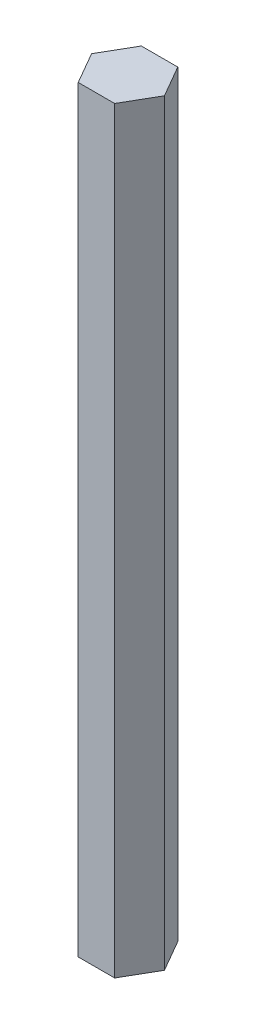
ISO-10303-21;
HEADER;
FILE_DESCRIPTION(('STEP AP214'),'2;1');
FILE_NAME('part.step','',(''),(''),'','','');
FILE_SCHEMA(('AUTOMOTIVE_DESIGN { 1 0 10303 214 1 1 1 1 }'));
ENDSEC;
DATA;
#1=APPLICATION_CONTEXT('core data for automotive mechanical design processes');
#2=APPLICATION_PROTOCOL_DEFINITION('international standard','automotive_design',2000,#1);
#3=PRODUCT_CONTEXT('',#1,'mechanical');
#4=PRODUCT('Part','Part','',(#3));
#5=PRODUCT_RELATED_PRODUCT_CATEGORY('part','',(#4));
#6=PRODUCT_DEFINITION_FORMATION('','',#4);
#7=PRODUCT_DEFINITION_CONTEXT('part definition',#1,'design');
#8=PRODUCT_DEFINITION('design','',#6,#7);
#9=PRODUCT_DEFINITION_SHAPE('','',#8);
#10=(LENGTH_UNIT() NAMED_UNIT(*) SI_UNIT(.MILLI.,.METRE.));
#11=(NAMED_UNIT(*) PLANE_ANGLE_UNIT() SI_UNIT($,.RADIAN.));
#12=(NAMED_UNIT(*) SI_UNIT($,.STERADIAN.) SOLID_ANGLE_UNIT());
#13=UNCERTAINTY_MEASURE_WITH_UNIT(LENGTH_MEASURE(1.E-05),#10,'distance_accuracy_value','');
#14=(GEOMETRIC_REPRESENTATION_CONTEXT(3) GLOBAL_UNCERTAINTY_ASSIGNED_CONTEXT((#13)) GLOBAL_UNIT_ASSIGNED_CONTEXT((#10,
#11,#12)) REPRESENTATION_CONTEXT('',''));
#15=CARTESIAN_POINT('',(0.,0.,0.));
#16=DIRECTION('',(0.,0.,1.));
#17=DIRECTION('',(1.,0.,0.));
#18=AXIS2_PLACEMENT_3D('',#15,#16,#17);
#19=CARTESIAN_POINT('',(-3.66617420935412,152.4,6.35));
#20=DIRECTION('',(0.,0.,-1.));
#21=DIRECTION('',(-1.,0.,0.));
#22=AXIS2_PLACEMENT_3D('',#19,#20,#21);
#23=PLANE('',#22);
#24=DIRECTION('',(1.,0.,0.));
#25=VECTOR('',#24,1.);
#26=CARTESIAN_POINT('',(-3.66617420935412,0.,6.35));
#27=LINE('',#26,#25);
#28=CARTESIAN_POINT('',(-3.66617420935412,0.,6.35));
#29=VERTEX_POINT('',#28);
#30=CARTESIAN_POINT('',(3.66617420935412,0.,6.35));
#31=VERTEX_POINT('',#30);
#32=EDGE_CURVE('E132',#29,#31,#27,.T.);
#33=ORIENTED_EDGE('',*,*,#32,.T.);
#34=DIRECTION('',(0.,-1.,0.));
#35=VECTOR('',#34,1.);
#36=CARTESIAN_POINT('',(3.66617420935412,152.4,6.35));
#37=LINE('',#36,#35);
#38=CARTESIAN_POINT('',(3.66617420935412,152.4,6.35));
#39=VERTEX_POINT('',#38);
#40=EDGE_CURVE('E11',#39,#31,#37,.T.);
#41=ORIENTED_EDGE('',*,*,#40,.F.);
#42=DIRECTION('',(1.,0.,0.));
#43=VECTOR('',#42,1.);
#44=CARTESIAN_POINT('',(-3.66617420935412,152.4,6.35));
#45=LINE('',#44,#43);
#46=CARTESIAN_POINT('',(-3.66617420935412,152.4,6.35));
#47=VERTEX_POINT('',#46);
#48=EDGE_CURVE('E148',#47,#39,#45,.T.);
#49=ORIENTED_EDGE('',*,*,#48,.F.);
#50=DIRECTION('',(0.,-1.,0.));
#51=VECTOR('',#50,1.);
#52=CARTESIAN_POINT('',(-3.66617420935412,152.4,6.35));
#53=LINE('',#52,#51);
#54=EDGE_CURVE('E128',#47,#29,#53,.T.);
#55=ORIENTED_EDGE('',*,*,#54,.T.);
#56=EDGE_LOOP('',(#33,#41,#49,#55));
#57=FACE_BOUND('',#56,.T.);
#58=ADVANCED_FACE('F43',(#57),#23,.F.);
#59=CARTESIAN_POINT('',(3.66617420935412,152.4,6.35));
#60=DIRECTION('',(-0.866025403784439,0.,-0.5));
#61=DIRECTION('',(-0.5,0.,0.866025403784438));
#62=AXIS2_PLACEMENT_3D('',#59,#60,#61);
#63=PLANE('',#62);
#64=DIRECTION('',(0.5,0.,-0.866025403784438));
#65=VECTOR('',#64,1.);
#66=CARTESIAN_POINT('',(3.66617420935412,0.,6.35));
#67=LINE('',#66,#65);
#68=CARTESIAN_POINT('',(7.33234841870824,0.,0.));
#69=VERTEX_POINT('',#68);
#70=EDGE_CURVE('E136',#31,#69,#67,.T.);
#71=ORIENTED_EDGE('',*,*,#70,.T.);
#72=DIRECTION('',(0.,-1.,0.));
#73=VECTOR('',#72,1.);
#74=CARTESIAN_POINT('',(7.33234841870824,152.4,0.));
#75=LINE('',#74,#73);
#76=CARTESIAN_POINT('',(7.33234841870824,152.4,0.));
#77=VERTEX_POINT('',#76);
#78=EDGE_CURVE('E52',#77,#69,#75,.T.);
#79=ORIENTED_EDGE('',*,*,#78,.F.);
#80=DIRECTION('',(0.5,0.,-0.866025403784438));
#81=VECTOR('',#80,1.);
#82=CARTESIAN_POINT('',(3.66617420935412,152.4,6.35));
#83=LINE('',#82,#81);
#84=EDGE_CURVE('E97',#39,#77,#83,.T.);
#85=ORIENTED_EDGE('',*,*,#84,.F.);
#86=ORIENTED_EDGE('',*,*,#40,.T.);
#87=EDGE_LOOP('',(#71,#79,#85,#86));
#88=FACE_BOUND('',#87,.T.);
#89=ADVANCED_FACE('F176',(#88),#63,.F.);
#90=CARTESIAN_POINT('',(7.33234841870824,152.4,0.));
#91=DIRECTION('',(-0.866025403784439,0.,0.5));
#92=DIRECTION('',(0.5,0.,0.866025403784439));
#93=AXIS2_PLACEMENT_3D('',#90,#91,#92);
#94=PLANE('',#93);
#95=DIRECTION('',(-0.5,0.,-0.866025403784439));
#96=VECTOR('',#95,1.);
#97=CARTESIAN_POINT('',(7.33234841870824,0.,0.));
#98=LINE('',#97,#96);
#99=CARTESIAN_POINT('',(3.66617420935412,0.,-6.35));
#100=VERTEX_POINT('',#99);
#101=EDGE_CURVE('E139',#69,#100,#98,.T.);
#102=ORIENTED_EDGE('',*,*,#101,.T.);
#103=DIRECTION('',(0.,-1.,0.));
#104=VECTOR('',#103,1.);
#105=CARTESIAN_POINT('',(3.66617420935412,152.4,-6.35));
#106=LINE('',#105,#104);
#107=CARTESIAN_POINT('',(3.66617420935412,152.4,-6.35));
#108=VERTEX_POINT('',#107);
#109=EDGE_CURVE('E121',#108,#100,#106,.T.);
#110=ORIENTED_EDGE('',*,*,#109,.F.);
#111=DIRECTION('',(-0.5,0.,-0.866025403784439));
#112=VECTOR('',#111,1.);
#113=CARTESIAN_POINT('',(7.33234841870824,152.4,0.));
#114=LINE('',#113,#112);
#115=EDGE_CURVE('E110',#77,#108,#114,.T.);
#116=ORIENTED_EDGE('',*,*,#115,.F.);
#117=ORIENTED_EDGE('',*,*,#78,.T.);
#118=EDGE_LOOP('',(#102,#110,#116,#117));
#119=FACE_BOUND('',#118,.T.);
#120=ADVANCED_FACE('F158',(#119),#94,.F.);
#121=CARTESIAN_POINT('',(3.66617420935412,152.4,-6.35));
#122=DIRECTION('',(0.,0.,1.));
#123=DIRECTION('',(1.,0.,0.));
#124=AXIS2_PLACEMENT_3D('',#121,#122,#123);
#125=PLANE('',#124);
#126=DIRECTION('',(-1.,0.,0.));
#127=VECTOR('',#126,1.);
#128=CARTESIAN_POINT('',(3.66617420935412,0.,-6.35));
#129=LINE('',#128,#127);
#130=CARTESIAN_POINT('',(-3.66617420935412,0.,-6.35));
#131=VERTEX_POINT('',#130);
#132=EDGE_CURVE('E119',#100,#131,#129,.T.);
#133=ORIENTED_EDGE('',*,*,#132,.T.);
#134=DIRECTION('',(0.,-1.,0.));
#135=VECTOR('',#134,1.);
#136=CARTESIAN_POINT('',(-3.66617420935412,152.4,-6.35));
#137=LINE('',#136,#135);
#138=CARTESIAN_POINT('',(-3.66617420935412,152.4,-6.35));
#139=VERTEX_POINT('',#138);
#140=EDGE_CURVE('E116',#139,#131,#137,.T.);
#141=ORIENTED_EDGE('',*,*,#140,.F.);
#142=DIRECTION('',(-1.,0.,0.));
#143=VECTOR('',#142,1.);
#144=CARTESIAN_POINT('',(3.66617420935412,152.4,-6.35));
#145=LINE('',#144,#143);
#146=EDGE_CURVE('E104',#108,#139,#145,.T.);
#147=ORIENTED_EDGE('',*,*,#146,.F.);
#148=ORIENTED_EDGE('',*,*,#109,.T.);
#149=EDGE_LOOP('',(#133,#141,#147,#148));
#150=FACE_BOUND('',#149,.T.);
#151=ADVANCED_FACE('F117',(#150),#125,.F.);
#152=CARTESIAN_POINT('',(-3.66617420935412,152.4,-6.35));
#153=DIRECTION('',(0.866025403784439,0.,0.5));
#154=DIRECTION('',(0.5,0.,-0.866025403784438));
#155=AXIS2_PLACEMENT_3D('',#152,#153,#154);
#156=PLANE('',#155);
#157=DIRECTION('',(-0.5,0.,0.866025403784439));
#158=VECTOR('',#157,1.);
#159=CARTESIAN_POINT('',(-3.66617420935412,0.,-6.35));
#160=LINE('',#159,#158);
#161=CARTESIAN_POINT('',(-7.33234841870824,0.,0.));
#162=VERTEX_POINT('',#161);
#163=EDGE_CURVE('E83',#131,#162,#160,.T.);
#164=ORIENTED_EDGE('',*,*,#163,.T.);
#165=DIRECTION('',(0.,-1.,0.));
#166=VECTOR('',#165,1.);
#167=CARTESIAN_POINT('',(-7.33234841870824,152.4,0.));
#168=LINE('',#167,#166);
#169=CARTESIAN_POINT('',(-7.33234841870824,152.4,0.));
#170=VERTEX_POINT('',#169);
#171=EDGE_CURVE('E122',#170,#162,#168,.T.);
#172=ORIENTED_EDGE('',*,*,#171,.F.);
#173=DIRECTION('',(-0.5,0.,0.866025403784439));
#174=VECTOR('',#173,1.);
#175=CARTESIAN_POINT('',(-3.66617420935412,152.4,-6.35));
#176=LINE('',#175,#174);
#177=EDGE_CURVE('E108',#139,#170,#176,.T.);
#178=ORIENTED_EDGE('',*,*,#177,.F.);
#179=ORIENTED_EDGE('',*,*,#140,.T.);
#180=EDGE_LOOP('',(#164,#172,#178,#179));
#181=FACE_BOUND('',#180,.T.);
#182=ADVANCED_FACE('F124',(#181),#156,.F.);
#183=CARTESIAN_POINT('',(-7.33234841870824,152.4,0.));
#184=DIRECTION('',(0.866025403784439,0.,-0.5));
#185=DIRECTION('',(-0.5,0.,-0.866025403784439));
#186=AXIS2_PLACEMENT_3D('',#183,#184,#185);
#187=PLANE('',#186);
#188=DIRECTION('',(0.5,0.,0.866025403784439));
#189=VECTOR('',#188,1.);
#190=CARTESIAN_POINT('',(-7.33234841870824,0.,0.));
#191=LINE('',#190,#189);
#192=EDGE_CURVE('E89',#162,#29,#191,.T.);
#193=ORIENTED_EDGE('',*,*,#192,.T.);
#194=ORIENTED_EDGE('',*,*,#54,.F.);
#195=DIRECTION('',(0.5,0.,0.866025403784439));
#196=VECTOR('',#195,1.);
#197=CARTESIAN_POINT('',(-7.33234841870824,152.4,0.));
#198=LINE('',#197,#196);
#199=EDGE_CURVE('E60',#170,#47,#198,.T.);
#200=ORIENTED_EDGE('',*,*,#199,.F.);
#201=ORIENTED_EDGE('',*,*,#171,.T.);
#202=EDGE_LOOP('',(#193,#194,#200,#201));
#203=FACE_BOUND('',#202,.T.);
#204=ADVANCED_FACE('F165',(#203),#187,.F.);
#205=CARTESIAN_POINT('',(0.,152.4,0.));
#206=DIRECTION('',(0.,1.,0.));
#207=DIRECTION('',(0.,0.,1.));
#208=AXIS2_PLACEMENT_3D('',#205,#206,#207);
#209=PLANE('',#208);
#210=ORIENTED_EDGE('',*,*,#48,.T.);
#211=ORIENTED_EDGE('',*,*,#84,.T.);
#212=ORIENTED_EDGE('',*,*,#115,.T.);
#213=ORIENTED_EDGE('',*,*,#146,.T.);
#214=ORIENTED_EDGE('',*,*,#177,.T.);
#215=ORIENTED_EDGE('',*,*,#199,.T.);
#216=EDGE_LOOP('',(#210,#211,#212,#213,#214,#215));
#217=FACE_BOUND('',#216,.T.);
#218=ADVANCED_FACE('F106',(#217),#209,.T.);
#219=CARTESIAN_POINT('',(0.,0.,0.));
#220=DIRECTION('',(0.,1.,0.));
#221=DIRECTION('',(0.,0.,1.));
#222=AXIS2_PLACEMENT_3D('',#219,#220,#221);
#223=PLANE('',#222);
#224=ORIENTED_EDGE('',*,*,#32,.F.);
#225=ORIENTED_EDGE('',*,*,#192,.F.);
#226=ORIENTED_EDGE('',*,*,#163,.F.);
#227=ORIENTED_EDGE('',*,*,#132,.F.);
#228=ORIENTED_EDGE('',*,*,#101,.F.);
#229=ORIENTED_EDGE('',*,*,#70,.F.);
#230=EDGE_LOOP('',(#224,#225,#226,#227,#228,#229));
#231=FACE_BOUND('',#230,.T.);
#232=ADVANCED_FACE('F161',(#231),#223,.F.);
#233=CLOSED_SHELL('',(#58,#89,#120,#151,#182,#204,#218,#232));
#234=MANIFOLD_SOLID_BREP('B2',#233);
#235=ADVANCED_BREP_SHAPE_REPRESENTATION('',(#18,#234),#14);
#236=SHAPE_DEFINITION_REPRESENTATION(#9,#235);
ENDSEC;
END-ISO-10303-21;
